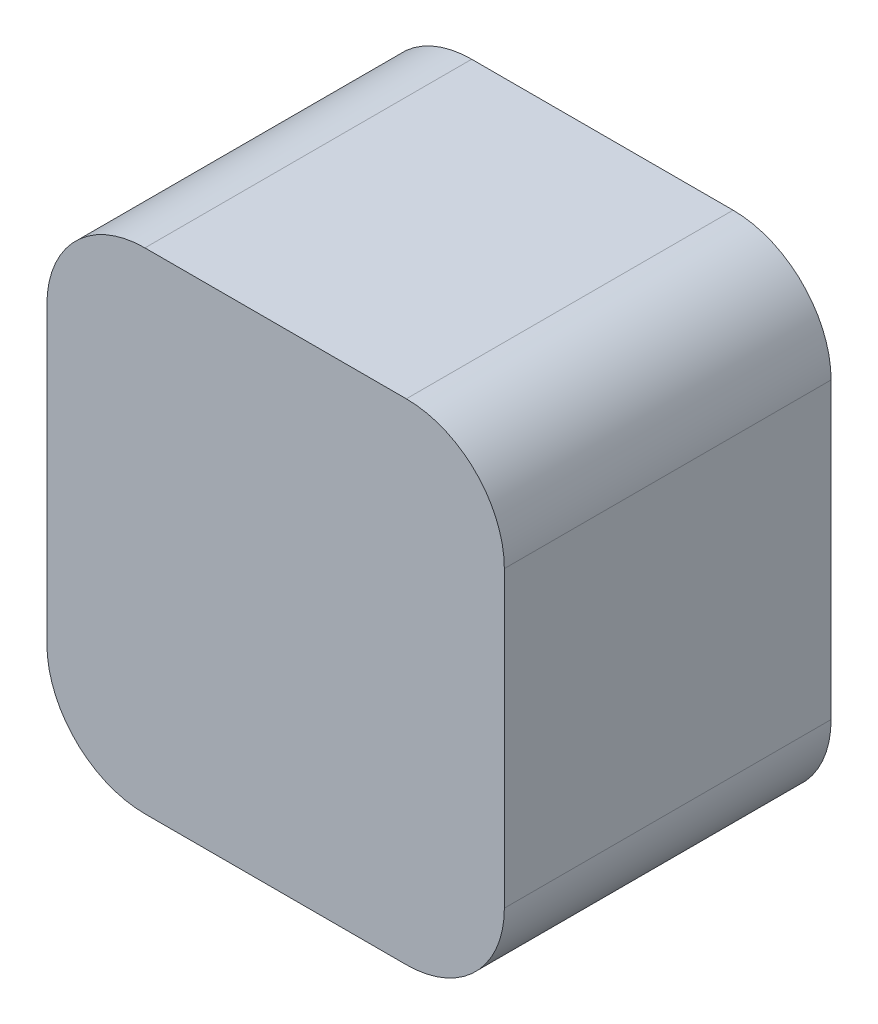
ISO-10303-21;
HEADER;
FILE_DESCRIPTION(('STEP AP214'),'2;1');
FILE_NAME('part.step','',(''),(''),'','','');
FILE_SCHEMA(('AUTOMOTIVE_DESIGN { 1 0 10303 214 1 1 1 1 }'));
ENDSEC;
DATA;
#1=APPLICATION_CONTEXT('core data for automotive mechanical design processes');
#2=APPLICATION_PROTOCOL_DEFINITION('international standard','automotive_design',2000,#1);
#3=PRODUCT_CONTEXT('',#1,'mechanical');
#4=PRODUCT('Part','Part','',(#3));
#5=PRODUCT_RELATED_PRODUCT_CATEGORY('part','',(#4));
#6=PRODUCT_DEFINITION_FORMATION('','',#4);
#7=PRODUCT_DEFINITION_CONTEXT('part definition',#1,'design');
#8=PRODUCT_DEFINITION('design','',#6,#7);
#9=PRODUCT_DEFINITION_SHAPE('','',#8);
#10=(LENGTH_UNIT() NAMED_UNIT(*) SI_UNIT(.MILLI.,.METRE.));
#11=(NAMED_UNIT(*) PLANE_ANGLE_UNIT() SI_UNIT($,.RADIAN.));
#12=(NAMED_UNIT(*) SI_UNIT($,.STERADIAN.) SOLID_ANGLE_UNIT());
#13=UNCERTAINTY_MEASURE_WITH_UNIT(LENGTH_MEASURE(1.E-05),#10,'distance_accuracy_value','');
#14=(GEOMETRIC_REPRESENTATION_CONTEXT(3) GLOBAL_UNCERTAINTY_ASSIGNED_CONTEXT((#13)) GLOBAL_UNIT_ASSIGNED_CONTEXT((#10,
#11,#12)) REPRESENTATION_CONTEXT('',''));
#15=CARTESIAN_POINT('',(0.,0.,0.));
#16=DIRECTION('',(0.,0.,1.));
#17=DIRECTION('',(1.,0.,0.));
#18=AXIS2_PLACEMENT_3D('',#15,#16,#17);
#19=CARTESIAN_POINT('',(0.,0.,10.));
#20=DIRECTION('',(1.,0.,0.));
#21=DIRECTION('',(0.,0.,-1.));
#22=AXIS2_PLACEMENT_3D('',#19,#20,#21);
#23=PLANE('',#22);
#24=DIRECTION('',(0.,-1.,0.));
#25=VECTOR('',#24,1.);
#26=CARTESIAN_POINT('',(0.,0.,0.));
#27=LINE('',#26,#25);
#28=CARTESIAN_POINT('',(0.,12.,0.));
#29=VERTEX_POINT('',#28);
#30=CARTESIAN_POINT('',(0.,3.,0.));
#31=VERTEX_POINT('',#30);
#32=EDGE_CURVE('E125',#29,#31,#27,.T.);
#33=ORIENTED_EDGE('',*,*,#32,.T.);
#34=DIRECTION('',(0.,0.,-1.));
#35=VECTOR('',#34,1.);
#36=CARTESIAN_POINT('',(0.,3.,10.));
#37=LINE('',#36,#35);
#38=CARTESIAN_POINT('',(0.,3.,10.));
#39=VERTEX_POINT('',#38);
#40=EDGE_CURVE('E103',#31,#39,#37,.F.);
#41=ORIENTED_EDGE('',*,*,#40,.T.);
#42=DIRECTION('',(0.,-1.,0.));
#43=VECTOR('',#42,1.);
#44=CARTESIAN_POINT('',(0.,0.,10.));
#45=LINE('',#44,#43);
#46=CARTESIAN_POINT('',(0.,12.,10.));
#47=VERTEX_POINT('',#46);
#48=EDGE_CURVE('E134',#47,#39,#45,.T.);
#49=ORIENTED_EDGE('',*,*,#48,.F.);
#50=DIRECTION('',(0.,0.,-1.));
#51=VECTOR('',#50,1.);
#52=CARTESIAN_POINT('',(0.,12.,10.));
#53=LINE('',#52,#51);
#54=EDGE_CURVE('E108',#47,#29,#53,.T.);
#55=ORIENTED_EDGE('',*,*,#54,.T.);
#56=EDGE_LOOP('',(#33,#41,#49,#55));
#57=FACE_BOUND('',#56,.T.);
#58=ADVANCED_FACE('F33',(#57),#23,.F.);
#59=CARTESIAN_POINT('',(0.,0.,10.));
#60=DIRECTION('',(0.,1.,0.));
#61=DIRECTION('',(0.,0.,1.));
#62=AXIS2_PLACEMENT_3D('',#59,#60,#61);
#63=PLANE('',#62);
#64=DIRECTION('',(1.,0.,0.));
#65=VECTOR('',#64,1.);
#66=CARTESIAN_POINT('',(0.,0.,10.));
#67=LINE('',#66,#65);
#68=CARTESIAN_POINT('',(3.,0.,10.));
#69=VERTEX_POINT('',#68);
#70=CARTESIAN_POINT('',(11.,0.,10.));
#71=VERTEX_POINT('',#70);
#72=EDGE_CURVE('E118',#69,#71,#67,.T.);
#73=ORIENTED_EDGE('',*,*,#72,.F.);
#74=DIRECTION('',(0.,0.,-1.));
#75=VECTOR('',#74,1.);
#76=CARTESIAN_POINT('',(3.,0.,10.));
#77=LINE('',#76,#75);
#78=CARTESIAN_POINT('',(3.,0.,0.));
#79=VERTEX_POINT('',#78);
#80=EDGE_CURVE('E102',#69,#79,#77,.T.);
#81=ORIENTED_EDGE('',*,*,#80,.T.);
#82=DIRECTION('',(1.,0.,0.));
#83=VECTOR('',#82,1.);
#84=CARTESIAN_POINT('',(0.,0.,0.));
#85=LINE('',#84,#83);
#86=CARTESIAN_POINT('',(11.,0.,0.));
#87=VERTEX_POINT('',#86);
#88=EDGE_CURVE('E115',#79,#87,#85,.T.);
#89=ORIENTED_EDGE('',*,*,#88,.T.);
#90=DIRECTION('',(0.,0.,-1.));
#91=VECTOR('',#90,1.);
#92=CARTESIAN_POINT('',(11.,0.,10.));
#93=LINE('',#92,#91);
#94=EDGE_CURVE('E120',#87,#71,#93,.F.);
#95=ORIENTED_EDGE('',*,*,#94,.T.);
#96=EDGE_LOOP('',(#73,#81,#89,#95));
#97=FACE_BOUND('',#96,.T.);
#98=ADVANCED_FACE('F114',(#97),#63,.F.);
#99=CARTESIAN_POINT('',(14.,0.,10.));
#100=DIRECTION('',(-1.,0.,0.));
#101=DIRECTION('',(0.,0.,1.));
#102=AXIS2_PLACEMENT_3D('',#99,#100,#101);
#103=PLANE('',#102);
#104=DIRECTION('',(0.,1.,0.));
#105=VECTOR('',#104,1.);
#106=CARTESIAN_POINT('',(14.,0.,10.));
#107=LINE('',#106,#105);
#108=CARTESIAN_POINT('',(14.,3.,10.));
#109=VERTEX_POINT('',#108);
#110=CARTESIAN_POINT('',(14.,12.,10.));
#111=VERTEX_POINT('',#110);
#112=EDGE_CURVE('E168',#109,#111,#107,.T.);
#113=ORIENTED_EDGE('',*,*,#112,.F.);
#114=DIRECTION('',(0.,0.,-1.));
#115=VECTOR('',#114,1.);
#116=CARTESIAN_POINT('',(14.,3.,10.));
#117=LINE('',#116,#115);
#118=CARTESIAN_POINT('',(14.,3.,0.));
#119=VERTEX_POINT('',#118);
#120=EDGE_CURVE('E153',#109,#119,#117,.T.);
#121=ORIENTED_EDGE('',*,*,#120,.T.);
#122=DIRECTION('',(0.,1.,0.));
#123=VECTOR('',#122,1.);
#124=CARTESIAN_POINT('',(14.,0.,0.));
#125=LINE('',#124,#123);
#126=CARTESIAN_POINT('',(14.,12.,0.));
#127=VERTEX_POINT('',#126);
#128=EDGE_CURVE('E124',#119,#127,#125,.T.);
#129=ORIENTED_EDGE('',*,*,#128,.T.);
#130=DIRECTION('',(0.,0.,-1.));
#131=VECTOR('',#130,1.);
#132=CARTESIAN_POINT('',(14.,12.,10.));
#133=LINE('',#132,#131);
#134=EDGE_CURVE('E151',#127,#111,#133,.F.);
#135=ORIENTED_EDGE('',*,*,#134,.T.);
#136=EDGE_LOOP('',(#113,#121,#129,#135));
#137=FACE_BOUND('',#136,.T.);
#138=ADVANCED_FACE('F179',(#137),#103,.F.);
#139=CARTESIAN_POINT('',(0.,15.,10.));
#140=DIRECTION('',(0.,-1.,0.));
#141=DIRECTION('',(0.,0.,-1.));
#142=AXIS2_PLACEMENT_3D('',#139,#140,#141);
#143=PLANE('',#142);
#144=DIRECTION('',(-1.,0.,0.));
#145=VECTOR('',#144,1.);
#146=CARTESIAN_POINT('',(0.,15.,0.));
#147=LINE('',#146,#145);
#148=CARTESIAN_POINT('',(11.,15.,0.));
#149=VERTEX_POINT('',#148);
#150=CARTESIAN_POINT('',(3.,15.,0.));
#151=VERTEX_POINT('',#150);
#152=EDGE_CURVE('E128',#149,#151,#147,.T.);
#153=ORIENTED_EDGE('',*,*,#152,.T.);
#154=DIRECTION('',(0.,0.,-1.));
#155=VECTOR('',#154,1.);
#156=CARTESIAN_POINT('',(3.,15.,10.));
#157=LINE('',#156,#155);
#158=CARTESIAN_POINT('',(3.,15.,10.));
#159=VERTEX_POINT('',#158);
#160=EDGE_CURVE('E11',#151,#159,#157,.F.);
#161=ORIENTED_EDGE('',*,*,#160,.T.);
#162=DIRECTION('',(-1.,0.,0.));
#163=VECTOR('',#162,1.);
#164=CARTESIAN_POINT('',(0.,15.,10.));
#165=LINE('',#164,#163);
#166=CARTESIAN_POINT('',(11.,15.,10.));
#167=VERTEX_POINT('',#166);
#168=EDGE_CURVE('E135',#167,#159,#165,.T.);
#169=ORIENTED_EDGE('',*,*,#168,.F.);
#170=DIRECTION('',(0.,0.,-1.));
#171=VECTOR('',#170,1.);
#172=CARTESIAN_POINT('',(11.,15.,10.));
#173=LINE('',#172,#171);
#174=EDGE_CURVE('E41',#167,#149,#173,.T.);
#175=ORIENTED_EDGE('',*,*,#174,.T.);
#176=EDGE_LOOP('',(#153,#161,#169,#175));
#177=FACE_BOUND('',#176,.T.);
#178=ADVANCED_FACE('F158',(#177),#143,.F.);
#179=CARTESIAN_POINT('',(0.,0.,10.));
#180=DIRECTION('',(0.,0.,-1.));
#181=DIRECTION('',(-1.,0.,0.));
#182=AXIS2_PLACEMENT_3D('',#179,#180,#181);
#183=PLANE('',#182);
#184=ORIENTED_EDGE('',*,*,#48,.T.);
#185=CARTESIAN_POINT('',(3.,3.,10.));
#186=DIRECTION('',(0.,0.,-1.));
#187=DIRECTION('',(-1.,0.,0.));
#188=AXIS2_PLACEMENT_3D('',#185,#186,#187);
#189=CIRCLE('',#188,3.);
#190=EDGE_CURVE('E149',#39,#69,#189,.F.);
#191=ORIENTED_EDGE('',*,*,#190,.T.);
#192=ORIENTED_EDGE('',*,*,#72,.T.);
#193=CARTESIAN_POINT('',(11.,3.,10.));
#194=DIRECTION('',(0.,0.,-1.));
#195=DIRECTION('',(-1.,0.,0.));
#196=AXIS2_PLACEMENT_3D('',#193,#194,#195);
#197=CIRCLE('',#196,3.);
#198=EDGE_CURVE('E147',#71,#109,#197,.F.);
#199=ORIENTED_EDGE('',*,*,#198,.T.);
#200=ORIENTED_EDGE('',*,*,#112,.T.);
#201=CARTESIAN_POINT('',(11.,12.,10.));
#202=DIRECTION('',(0.,0.,-1.));
#203=DIRECTION('',(-1.,0.,0.));
#204=AXIS2_PLACEMENT_3D('',#201,#202,#203);
#205=CIRCLE('',#204,3.);
#206=EDGE_CURVE('E53',#111,#167,#205,.F.);
#207=ORIENTED_EDGE('',*,*,#206,.T.);
#208=ORIENTED_EDGE('',*,*,#168,.T.);
#209=CARTESIAN_POINT('',(3.,12.,10.));
#210=DIRECTION('',(0.,0.,-1.));
#211=DIRECTION('',(-1.,0.,0.));
#212=AXIS2_PLACEMENT_3D('',#209,#210,#211);
#213=CIRCLE('',#212,3.);
#214=EDGE_CURVE('E145',#159,#47,#213,.F.);
#215=ORIENTED_EDGE('',*,*,#214,.T.);
#216=EDGE_LOOP('',(#184,#191,#192,#199,#200,#207,#208,#215));
#217=FACE_BOUND('',#216,.T.);
#218=ADVANCED_FACE('F171',(#217),#183,.F.);
#219=CARTESIAN_POINT('',(0.,0.,0.));
#220=DIRECTION('',(0.,0.,-1.));
#221=DIRECTION('',(-1.,0.,0.));
#222=AXIS2_PLACEMENT_3D('',#219,#220,#221);
#223=PLANE('',#222);
#224=ORIENTED_EDGE('',*,*,#88,.F.);
#225=CARTESIAN_POINT('',(3.,3.,0.));
#226=DIRECTION('',(0.,0.,-1.));
#227=DIRECTION('',(-1.,0.,0.));
#228=AXIS2_PLACEMENT_3D('',#225,#226,#227);
#229=CIRCLE('',#228,3.);
#230=EDGE_CURVE('E98',#79,#31,#229,.T.);
#231=ORIENTED_EDGE('',*,*,#230,.T.);
#232=ORIENTED_EDGE('',*,*,#32,.F.);
#233=CARTESIAN_POINT('',(3.,12.,0.));
#234=DIRECTION('',(0.,0.,-1.));
#235=DIRECTION('',(-1.,0.,0.));
#236=AXIS2_PLACEMENT_3D('',#233,#234,#235);
#237=CIRCLE('',#236,3.);
#238=EDGE_CURVE('E138',#29,#151,#237,.T.);
#239=ORIENTED_EDGE('',*,*,#238,.T.);
#240=ORIENTED_EDGE('',*,*,#152,.F.);
#241=CARTESIAN_POINT('',(11.,12.,0.));
#242=DIRECTION('',(0.,0.,-1.));
#243=DIRECTION('',(-1.,0.,0.));
#244=AXIS2_PLACEMENT_3D('',#241,#242,#243);
#245=CIRCLE('',#244,3.);
#246=EDGE_CURVE('E119',#149,#127,#245,.T.);
#247=ORIENTED_EDGE('',*,*,#246,.T.);
#248=ORIENTED_EDGE('',*,*,#128,.F.);
#249=CARTESIAN_POINT('',(11.,3.,0.));
#250=DIRECTION('',(0.,0.,-1.));
#251=DIRECTION('',(-1.,0.,0.));
#252=AXIS2_PLACEMENT_3D('',#249,#250,#251);
#253=CIRCLE('',#252,3.);
#254=EDGE_CURVE('E109',#119,#87,#253,.T.);
#255=ORIENTED_EDGE('',*,*,#254,.T.);
#256=EDGE_LOOP('',(#224,#231,#232,#239,#240,#247,#248,#255));
#257=FACE_BOUND('',#256,.T.);
#258=ADVANCED_FACE('F122',(#257),#223,.T.);
#259=CARTESIAN_POINT('',(3.,3.,10.));
#260=DIRECTION('',(0.,0.,-1.));
#261=DIRECTION('',(-1.,0.,0.));
#262=AXIS2_PLACEMENT_3D('',#259,#260,#261);
#263=CYLINDRICAL_SURFACE('',#262,3.);
#264=ORIENTED_EDGE('',*,*,#190,.F.);
#265=ORIENTED_EDGE('',*,*,#40,.F.);
#266=ORIENTED_EDGE('',*,*,#230,.F.);
#267=ORIENTED_EDGE('',*,*,#80,.F.);
#268=EDGE_LOOP('',(#264,#265,#266,#267));
#269=FACE_BOUND('',#268,.T.);
#270=ADVANCED_FACE('F101',(#269),#263,.T.);
#271=CARTESIAN_POINT('',(11.,3.,10.));
#272=DIRECTION('',(0.,0.,-1.));
#273=DIRECTION('',(-1.,0.,0.));
#274=AXIS2_PLACEMENT_3D('',#271,#272,#273);
#275=CYLINDRICAL_SURFACE('',#274,3.);
#276=ORIENTED_EDGE('',*,*,#198,.F.);
#277=ORIENTED_EDGE('',*,*,#94,.F.);
#278=ORIENTED_EDGE('',*,*,#254,.F.);
#279=ORIENTED_EDGE('',*,*,#120,.F.);
#280=EDGE_LOOP('',(#276,#277,#278,#279));
#281=FACE_BOUND('',#280,.T.);
#282=ADVANCED_FACE('F191',(#281),#275,.T.);
#283=CARTESIAN_POINT('',(3.,12.,10.));
#284=DIRECTION('',(0.,0.,-1.));
#285=DIRECTION('',(-1.,0.,0.));
#286=AXIS2_PLACEMENT_3D('',#283,#284,#285);
#287=CYLINDRICAL_SURFACE('',#286,3.);
#288=ORIENTED_EDGE('',*,*,#214,.F.);
#289=ORIENTED_EDGE('',*,*,#160,.F.);
#290=ORIENTED_EDGE('',*,*,#238,.F.);
#291=ORIENTED_EDGE('',*,*,#54,.F.);
#292=EDGE_LOOP('',(#288,#289,#290,#291));
#293=FACE_BOUND('',#292,.T.);
#294=ADVANCED_FACE('F163',(#293),#287,.T.);
#295=CARTESIAN_POINT('',(11.,12.,10.));
#296=DIRECTION('',(0.,0.,-1.));
#297=DIRECTION('',(-1.,0.,0.));
#298=AXIS2_PLACEMENT_3D('',#295,#296,#297);
#299=CYLINDRICAL_SURFACE('',#298,3.);
#300=ORIENTED_EDGE('',*,*,#206,.F.);
#301=ORIENTED_EDGE('',*,*,#134,.F.);
#302=ORIENTED_EDGE('',*,*,#246,.F.);
#303=ORIENTED_EDGE('',*,*,#174,.F.);
#304=EDGE_LOOP('',(#300,#301,#302,#303));
#305=FACE_BOUND('',#304,.T.);
#306=ADVANCED_FACE('F35',(#305),#299,.T.);
#307=CLOSED_SHELL('',(#58,#98,#138,#178,#218,#258,#270,#282,#294,#306));
#308=MANIFOLD_SOLID_BREP('B2',#307);
#309=ADVANCED_BREP_SHAPE_REPRESENTATION('',(#18,#308),#14);
#310=SHAPE_DEFINITION_REPRESENTATION(#9,#309);
ENDSEC;
END-ISO-10303-21;
